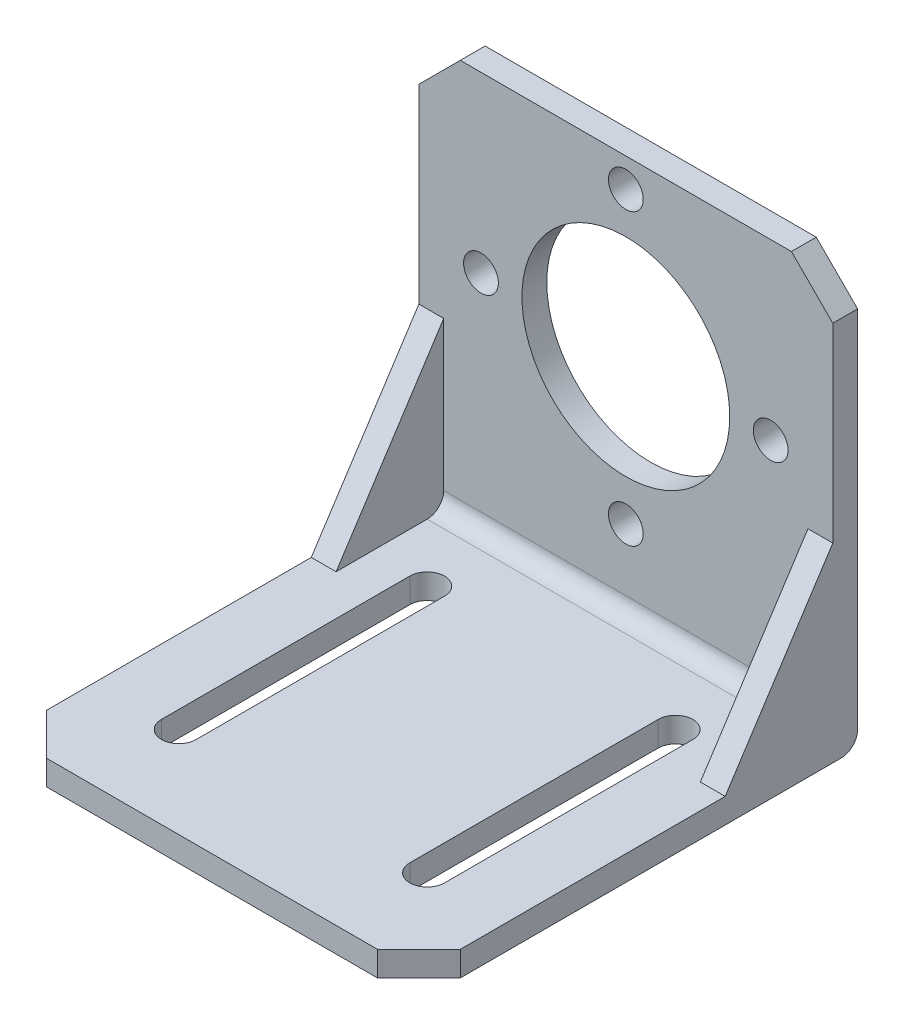
ISO-10303-21;
HEADER;
FILE_DESCRIPTION(('STEP AP214'),'2;1');
FILE_NAME('part.step','',(''),(''),'','','');
FILE_SCHEMA(('AUTOMOTIVE_DESIGN { 1 0 10303 214 1 1 1 1 }'));
ENDSEC;
DATA;
#1=APPLICATION_CONTEXT('core data for automotive mechanical design processes');
#2=APPLICATION_PROTOCOL_DEFINITION('international standard','automotive_design',2000,#1);
#3=PRODUCT_CONTEXT('',#1,'mechanical');
#4=PRODUCT('Part','Part','',(#3));
#5=PRODUCT_RELATED_PRODUCT_CATEGORY('part','',(#4));
#6=PRODUCT_DEFINITION_FORMATION('','',#4);
#7=PRODUCT_DEFINITION_CONTEXT('part definition',#1,'design');
#8=PRODUCT_DEFINITION('design','',#6,#7);
#9=PRODUCT_DEFINITION_SHAPE('','',#8);
#10=(LENGTH_UNIT() NAMED_UNIT(*) SI_UNIT(.MILLI.,.METRE.));
#11=(NAMED_UNIT(*) PLANE_ANGLE_UNIT() SI_UNIT($,.RADIAN.));
#12=(NAMED_UNIT(*) SI_UNIT($,.STERADIAN.) SOLID_ANGLE_UNIT());
#13=UNCERTAINTY_MEASURE_WITH_UNIT(LENGTH_MEASURE(1.E-05),#10,'distance_accuracy_value','');
#14=(GEOMETRIC_REPRESENTATION_CONTEXT(3) GLOBAL_UNCERTAINTY_ASSIGNED_CONTEXT((#13)) GLOBAL_UNIT_ASSIGNED_CONTEXT((#10,
#11,#12)) REPRESENTATION_CONTEXT('',''));
#15=CARTESIAN_POINT('',(0.,0.,0.));
#16=DIRECTION('',(0.,0.,1.));
#17=DIRECTION('',(1.,0.,0.));
#18=AXIS2_PLACEMENT_3D('',#15,#16,#17);
#19=CARTESIAN_POINT('',(0.,0.,3.));
#20=DIRECTION('',(0.,0.,-1.));
#21=DIRECTION('',(-1.,0.,0.));
#22=AXIS2_PLACEMENT_3D('',#19,#20,#21);
#23=PLANE('',#22);
#24=CARTESIAN_POINT('',(0.,4.5,3.));
#25=DIRECTION('',(0.,0.,1.));
#26=DIRECTION('',(1.,0.,0.));
#27=AXIS2_PLACEMENT_3D('',#24,#25,#26);
#28=CIRCLE('',#27,12.55);
#29=CARTESIAN_POINT('',(12.55,4.5,3.));
#30=VERTEX_POINT('',#29);
#31=EDGE_CURVE('E255',#30,#30,#28,.T.);
#32=ORIENTED_EDGE('',*,*,#31,.F.);
#33=EDGE_LOOP('',(#32));
#34=FACE_BOUND('',#33,.T.);
#35=CARTESIAN_POINT('',(-17.5,4.5,3.));
#36=DIRECTION('',(0.,0.,1.));
#37=DIRECTION('',(1.,0.,0.));
#38=AXIS2_PLACEMENT_3D('',#35,#36,#37);
#39=CIRCLE('',#38,2.1);
#40=CARTESIAN_POINT('',(-15.4,4.5,3.));
#41=VERTEX_POINT('',#40);
#42=EDGE_CURVE('E243',#41,#41,#39,.T.);
#43=ORIENTED_EDGE('',*,*,#42,.F.);
#44=EDGE_LOOP('',(#43));
#45=FACE_BOUND('',#44,.T.);
#46=CARTESIAN_POINT('',(17.5,4.5,3.));
#47=DIRECTION('',(0.,0.,1.));
#48=DIRECTION('',(1.,0.,0.));
#49=AXIS2_PLACEMENT_3D('',#46,#47,#48);
#50=CIRCLE('',#49,2.1);
#51=CARTESIAN_POINT('',(19.6,4.5,3.));
#52=VERTEX_POINT('',#51);
#53=EDGE_CURVE('E246',#52,#52,#50,.T.);
#54=ORIENTED_EDGE('',*,*,#53,.F.);
#55=EDGE_LOOP('',(#54));
#56=FACE_BOUND('',#55,.T.);
#57=CARTESIAN_POINT('',(0.,-13.,3.));
#58=DIRECTION('',(0.,0.,1.));
#59=DIRECTION('',(1.,0.,0.));
#60=AXIS2_PLACEMENT_3D('',#57,#58,#59);
#61=CIRCLE('',#60,2.1);
#62=CARTESIAN_POINT('',(2.1,-13.,3.));
#63=VERTEX_POINT('',#62);
#64=EDGE_CURVE('E249',#63,#63,#61,.T.);
#65=ORIENTED_EDGE('',*,*,#64,.F.);
#66=EDGE_LOOP('',(#65));
#67=FACE_BOUND('',#66,.T.);
#68=CARTESIAN_POINT('',(0.,22.,3.));
#69=DIRECTION('',(0.,0.,1.));
#70=DIRECTION('',(1.,0.,0.));
#71=AXIS2_PLACEMENT_3D('',#68,#69,#70);
#72=CIRCLE('',#71,2.1);
#73=CARTESIAN_POINT('',(2.1,22.,3.));
#74=VERTEX_POINT('',#73);
#75=EDGE_CURVE('E252',#74,#74,#72,.T.);
#76=ORIENTED_EDGE('',*,*,#75,.F.);
#77=EDGE_LOOP('',(#76));
#78=FACE_BOUND('',#77,.T.);
#79=DIRECTION('',(1.,0.,0.));
#80=VECTOR('',#79,1.);
#81=CARTESIAN_POINT('',(22.,-2.5,3.));
#82=LINE('',#81,#80);
#83=CARTESIAN_POINT('',(22.,-2.5,3.));
#84=VERTEX_POINT('',#83);
#85=CARTESIAN_POINT('',(25.,-2.5,3.));
#86=VERTEX_POINT('',#85);
#87=EDGE_CURVE('E207',#84,#86,#82,.T.);
#88=ORIENTED_EDGE('',*,*,#87,.T.);
#89=DIRECTION('',(0.,1.,0.));
#90=VECTOR('',#89,1.);
#91=CARTESIAN_POINT('',(25.,-25.5,3.));
#92=LINE('',#91,#90);
#93=CARTESIAN_POINT('',(25.,20.5,3.));
#94=VERTEX_POINT('',#93);
#95=EDGE_CURVE('E334',#86,#94,#92,.T.);
#96=ORIENTED_EDGE('',*,*,#95,.T.);
#97=DIRECTION('',(0.707106781186547,-0.707106781186549,0.));
#98=VECTOR('',#97,1.);
#99=CARTESIAN_POINT('',(20.,25.5,3.));
#100=LINE('',#99,#98);
#101=CARTESIAN_POINT('',(20.,25.5,3.));
#102=VERTEX_POINT('',#101);
#103=EDGE_CURVE('E11',#94,#102,#100,.F.);
#104=ORIENTED_EDGE('',*,*,#103,.T.);
#105=DIRECTION('',(-1.,0.,0.));
#106=VECTOR('',#105,1.);
#107=CARTESIAN_POINT('',(-25.,25.5,3.));
#108=LINE('',#107,#106);
#109=CARTESIAN_POINT('',(-20.,25.5,3.));
#110=VERTEX_POINT('',#109);
#111=EDGE_CURVE('E336',#102,#110,#108,.T.);
#112=ORIENTED_EDGE('',*,*,#111,.T.);
#113=DIRECTION('',(0.707106781186549,0.707106781186547,0.));
#114=VECTOR('',#113,1.);
#115=CARTESIAN_POINT('',(-25.,20.5,3.));
#116=LINE('',#115,#114);
#117=CARTESIAN_POINT('',(-25.,20.5,3.));
#118=VERTEX_POINT('',#117);
#119=EDGE_CURVE('E43',#110,#118,#116,.F.);
#120=ORIENTED_EDGE('',*,*,#119,.T.);
#121=DIRECTION('',(0.,-1.,0.));
#122=VECTOR('',#121,1.);
#123=CARTESIAN_POINT('',(-25.,-25.5,3.));
#124=LINE('',#123,#122);
#125=CARTESIAN_POINT('',(-25.,-2.5,3.));
#126=VERTEX_POINT('',#125);
#127=EDGE_CURVE('E340',#118,#126,#124,.T.);
#128=ORIENTED_EDGE('',*,*,#127,.T.);
#129=DIRECTION('',(-1.,0.,0.));
#130=VECTOR('',#129,1.);
#131=CARTESIAN_POINT('',(-22.,-2.5,3.));
#132=LINE('',#131,#130);
#133=CARTESIAN_POINT('',(-22.,-2.5,3.));
#134=VERTEX_POINT('',#133);
#135=EDGE_CURVE('E241',#134,#126,#132,.T.);
#136=ORIENTED_EDGE('',*,*,#135,.F.);
#137=DIRECTION('',(0.,-1.,0.));
#138=VECTOR('',#137,1.);
#139=CARTESIAN_POINT('',(-22.,-20.5,3.));
#140=LINE('',#139,#138);
#141=CARTESIAN_POINT('',(-22.,-20.5,3.));
#142=VERTEX_POINT('',#141);
#143=EDGE_CURVE('E227',#134,#142,#140,.T.);
#144=ORIENTED_EDGE('',*,*,#143,.T.);
#145=DIRECTION('',(-1.,0.,0.));
#146=VECTOR('',#145,1.);
#147=CARTESIAN_POINT('',(25.,-20.5,3.));
#148=LINE('',#147,#146);
#149=CARTESIAN_POINT('',(22.,-20.5,3.));
#150=VERTEX_POINT('',#149);
#151=EDGE_CURVE('E219',#142,#150,#148,.F.);
#152=ORIENTED_EDGE('',*,*,#151,.T.);
#153=DIRECTION('',(0.,-1.,0.));
#154=VECTOR('',#153,1.);
#155=CARTESIAN_POINT('',(22.,-20.5,3.));
#156=LINE('',#155,#154);
#157=EDGE_CURVE('E199',#84,#150,#156,.T.);
#158=ORIENTED_EDGE('',*,*,#157,.F.);
#159=EDGE_LOOP('',(#88,#96,#104,#112,#120,#128,#136,#144,#152,#158));
#160=FACE_BOUND('',#159,.T.);
#161=ADVANCED_FACE('F34',(#34,#45,#56,#67,#78,#160),#23,.F.);
#162=CARTESIAN_POINT('',(-25.,-22.5,53.));
#163=DIRECTION('',(0.,-1.,0.));
#164=DIRECTION('',(0.,0.,-1.));
#165=AXIS2_PLACEMENT_3D('',#162,#163,#164);
#166=PLANE('',#165);
#167=DIRECTION('',(0.,0.,-1.));
#168=VECTOR('',#167,1.);
#169=CARTESIAN_POINT('',(17.1,-22.5,42.));
#170=LINE('',#169,#168);
#171=CARTESIAN_POINT('',(17.1,-22.5,42.));
#172=VERTEX_POINT('',#171);
#173=CARTESIAN_POINT('',(17.1,-22.5,12.));
#174=VERTEX_POINT('',#173);
#175=EDGE_CURVE('E283',#172,#174,#170,.T.);
#176=ORIENTED_EDGE('',*,*,#175,.F.);
#177=CARTESIAN_POINT('',(15.,-22.5,42.));
#178=DIRECTION('',(0.,1.,0.));
#179=DIRECTION('',(0.,0.,1.));
#180=AXIS2_PLACEMENT_3D('',#177,#178,#179);
#181=CIRCLE('',#180,2.1);
#182=CARTESIAN_POINT('',(12.9,-22.5,42.));
#183=VERTEX_POINT('',#182);
#184=EDGE_CURVE('E281',#183,#172,#181,.T.);
#185=ORIENTED_EDGE('',*,*,#184,.F.);
#186=DIRECTION('',(0.,0.,1.));
#187=VECTOR('',#186,1.);
#188=CARTESIAN_POINT('',(12.9,-22.5,42.));
#189=LINE('',#188,#187);
#190=CARTESIAN_POINT('',(12.9,-22.5,12.));
#191=VERTEX_POINT('',#190);
#192=EDGE_CURVE('E288',#191,#183,#189,.T.);
#193=ORIENTED_EDGE('',*,*,#192,.F.);
#194=CARTESIAN_POINT('',(15.,-22.5,12.));
#195=DIRECTION('',(0.,1.,0.));
#196=DIRECTION('',(0.,0.,1.));
#197=AXIS2_PLACEMENT_3D('',#194,#195,#196);
#198=CIRCLE('',#197,2.1);
#199=EDGE_CURVE('E285',#174,#191,#198,.T.);
#200=ORIENTED_EDGE('',*,*,#199,.F.);
#201=EDGE_LOOP('',(#176,#185,#193,#200));
#202=FACE_BOUND('',#201,.T.);
#203=DIRECTION('',(0.,0.,-1.));
#204=VECTOR('',#203,1.);
#205=CARTESIAN_POINT('',(-12.9,-22.5,42.));
#206=LINE('',#205,#204);
#207=CARTESIAN_POINT('',(-12.9,-22.5,42.));
#208=VERTEX_POINT('',#207);
#209=CARTESIAN_POINT('',(-12.9,-22.5,12.));
#210=VERTEX_POINT('',#209);
#211=EDGE_CURVE('E263',#208,#210,#206,.T.);
#212=ORIENTED_EDGE('',*,*,#211,.F.);
#213=CARTESIAN_POINT('',(-15.,-22.5,42.));
#214=DIRECTION('',(0.,1.,0.));
#215=DIRECTION('',(0.,0.,1.));
#216=AXIS2_PLACEMENT_3D('',#213,#214,#215);
#217=CIRCLE('',#216,2.1);
#218=CARTESIAN_POINT('',(-17.1,-22.5,42.));
#219=VERTEX_POINT('',#218);
#220=EDGE_CURVE('E261',#219,#208,#217,.T.);
#221=ORIENTED_EDGE('',*,*,#220,.F.);
#222=DIRECTION('',(0.,0.,1.));
#223=VECTOR('',#222,1.);
#224=CARTESIAN_POINT('',(-17.1,-22.5,42.));
#225=LINE('',#224,#223);
#226=CARTESIAN_POINT('',(-17.1,-22.5,12.));
#227=VERTEX_POINT('',#226);
#228=EDGE_CURVE('E269',#227,#219,#225,.T.);
#229=ORIENTED_EDGE('',*,*,#228,.F.);
#230=CARTESIAN_POINT('',(-15.,-22.5,12.));
#231=DIRECTION('',(0.,1.,0.));
#232=DIRECTION('',(0.,0.,1.));
#233=AXIS2_PLACEMENT_3D('',#230,#231,#232);
#234=CIRCLE('',#233,2.1);
#235=EDGE_CURVE('E266',#210,#227,#234,.T.);
#236=ORIENTED_EDGE('',*,*,#235,.F.);
#237=EDGE_LOOP('',(#212,#221,#229,#236));
#238=FACE_BOUND('',#237,.T.);
#239=DIRECTION('',(1.,0.,0.));
#240=VECTOR('',#239,1.);
#241=CARTESIAN_POINT('',(22.,-22.5,16.));
#242=LINE('',#241,#240);
#243=CARTESIAN_POINT('',(22.,-22.5,16.));
#244=VERTEX_POINT('',#243);
#245=CARTESIAN_POINT('',(25.,-22.5,16.));
#246=VERTEX_POINT('',#245);
#247=EDGE_CURVE('E213',#244,#246,#242,.T.);
#248=ORIENTED_EDGE('',*,*,#247,.F.);
#249=DIRECTION('',(0.,0.,1.));
#250=VECTOR('',#249,1.);
#251=CARTESIAN_POINT('',(22.,-22.5,16.));
#252=LINE('',#251,#250);
#253=CARTESIAN_POINT('',(22.,-22.5,5.));
#254=VERTEX_POINT('',#253);
#255=EDGE_CURVE('E202',#254,#244,#252,.T.);
#256=ORIENTED_EDGE('',*,*,#255,.F.);
#257=DIRECTION('',(-1.,0.,0.));
#258=VECTOR('',#257,1.);
#259=CARTESIAN_POINT('',(-25.,-22.5,5.));
#260=LINE('',#259,#258);
#261=CARTESIAN_POINT('',(-22.,-22.5,5.));
#262=VERTEX_POINT('',#261);
#263=EDGE_CURVE('E364',#254,#262,#260,.T.);
#264=ORIENTED_EDGE('',*,*,#263,.T.);
#265=DIRECTION('',(0.,0.,1.));
#266=VECTOR('',#265,1.);
#267=CARTESIAN_POINT('',(-22.,-22.5,16.));
#268=LINE('',#267,#266);
#269=CARTESIAN_POINT('',(-22.,-22.5,16.));
#270=VERTEX_POINT('',#269);
#271=EDGE_CURVE('E232',#262,#270,#268,.T.);
#272=ORIENTED_EDGE('',*,*,#271,.T.);
#273=DIRECTION('',(-1.,0.,0.));
#274=VECTOR('',#273,1.);
#275=CARTESIAN_POINT('',(-22.,-22.5,16.));
#276=LINE('',#275,#274);
#277=CARTESIAN_POINT('',(-25.,-22.5,16.));
#278=VERTEX_POINT('',#277);
#279=EDGE_CURVE('E238',#270,#278,#276,.T.);
#280=ORIENTED_EDGE('',*,*,#279,.T.);
#281=DIRECTION('',(0.,0.,-1.));
#282=VECTOR('',#281,1.);
#283=CARTESIAN_POINT('',(-25.,-22.5,53.));
#284=LINE('',#283,#282);
#285=CARTESIAN_POINT('',(-25.,-22.5,48.));
#286=VERTEX_POINT('',#285);
#287=EDGE_CURVE('E327',#286,#278,#284,.T.);
#288=ORIENTED_EDGE('',*,*,#287,.F.);
#289=DIRECTION('',(-0.707106781186547,0.,-0.707106781186549));
#290=VECTOR('',#289,1.);
#291=CARTESIAN_POINT('',(-20.,-22.5,53.));
#292=LINE('',#291,#290);
#293=CARTESIAN_POINT('',(-20.,-22.5,53.));
#294=VERTEX_POINT('',#293);
#295=EDGE_CURVE('E384',#286,#294,#292,.F.);
#296=ORIENTED_EDGE('',*,*,#295,.T.);
#297=DIRECTION('',(-1.,0.,0.));
#298=VECTOR('',#297,1.);
#299=CARTESIAN_POINT('',(-25.,-22.5,53.));
#300=LINE('',#299,#298);
#301=CARTESIAN_POINT('',(20.,-22.5,53.));
#302=VERTEX_POINT('',#301);
#303=EDGE_CURVE('E324',#302,#294,#300,.T.);
#304=ORIENTED_EDGE('',*,*,#303,.F.);
#305=DIRECTION('',(-0.707106781186547,0.,0.707106781186549));
#306=VECTOR('',#305,1.);
#307=CARTESIAN_POINT('',(20.,-22.5,53.));
#308=LINE('',#307,#306);
#309=CARTESIAN_POINT('',(25.,-22.5,48.));
#310=VERTEX_POINT('',#309);
#311=EDGE_CURVE('E382',#302,#310,#308,.F.);
#312=ORIENTED_EDGE('',*,*,#311,.T.);
#313=DIRECTION('',(0.,0.,-1.));
#314=VECTOR('',#313,1.);
#315=CARTESIAN_POINT('',(25.,-22.5,53.));
#316=LINE('',#315,#314);
#317=EDGE_CURVE('E330',#310,#246,#316,.T.);
#318=ORIENTED_EDGE('',*,*,#317,.T.);
#319=EDGE_LOOP('',(#248,#256,#264,#272,#280,#288,#296,#304,#312,#318));
#320=FACE_BOUND('',#319,.T.);
#321=ADVANCED_FACE('F451',(#202,#238,#320),#166,.F.);
#322=CARTESIAN_POINT('',(25.,-25.5,3.));
#323=DIRECTION('',(-1.,0.,0.));
#324=DIRECTION('',(0.,0.,1.));
#325=AXIS2_PLACEMENT_3D('',#322,#323,#324);
#326=PLANE('',#325);
#327=ORIENTED_EDGE('',*,*,#95,.F.);
#328=DIRECTION('',(0.,0.838443616300637,-0.544988350595414));
#329=VECTOR('',#328,1.);
#330=CARTESIAN_POINT('',(25.,-2.5,3.));
#331=LINE('',#330,#329);
#332=EDGE_CURVE('E210',#246,#86,#331,.T.);
#333=ORIENTED_EDGE('',*,*,#332,.F.);
#334=ORIENTED_EDGE('',*,*,#317,.F.);
#335=DIRECTION('',(0.,-1.,0.));
#336=VECTOR('',#335,1.);
#337=CARTESIAN_POINT('',(25.,-25.5,48.));
#338=LINE('',#337,#336);
#339=CARTESIAN_POINT('',(25.,-25.5,48.));
#340=VERTEX_POINT('',#339);
#341=EDGE_CURVE('E389',#310,#340,#338,.T.);
#342=ORIENTED_EDGE('',*,*,#341,.T.);
#343=DIRECTION('',(0.,0.,-1.));
#344=VECTOR('',#343,1.);
#345=CARTESIAN_POINT('',(25.,-25.5,3.));
#346=LINE('',#345,#344);
#347=CARTESIAN_POINT('',(25.,-25.5,2.));
#348=VERTEX_POINT('',#347);
#349=EDGE_CURVE('E343',#340,#348,#346,.T.);
#350=ORIENTED_EDGE('',*,*,#349,.T.);
#351=CARTESIAN_POINT('',(25.,-23.5,2.));
#352=DIRECTION('',(-1.,0.,0.));
#353=DIRECTION('',(0.,0.,1.));
#354=AXIS2_PLACEMENT_3D('',#351,#352,#353);
#355=CIRCLE('',#354,2.);
#356=CARTESIAN_POINT('',(25.,-23.5,0.));
#357=VERTEX_POINT('',#356);
#358=EDGE_CURVE('E356',#348,#357,#355,.F.);
#359=ORIENTED_EDGE('',*,*,#358,.T.);
#360=DIRECTION('',(0.,1.,0.));
#361=VECTOR('',#360,1.);
#362=CARTESIAN_POINT('',(25.,-25.5,0.));
#363=LINE('',#362,#361);
#364=CARTESIAN_POINT('',(25.,20.5,0.));
#365=VERTEX_POINT('',#364);
#366=EDGE_CURVE('E333',#357,#365,#363,.T.);
#367=ORIENTED_EDGE('',*,*,#366,.T.);
#368=DIRECTION('',(0.,0.,1.));
#369=VECTOR('',#368,1.);
#370=CARTESIAN_POINT('',(25.,20.5,3.));
#371=LINE('',#370,#369);
#372=EDGE_CURVE('E386',#365,#94,#371,.T.);
#373=ORIENTED_EDGE('',*,*,#372,.T.);
#374=EDGE_LOOP('',(#327,#333,#334,#342,#350,#359,#367,#373));
#375=FACE_BOUND('',#374,.T.);
#376=ADVANCED_FACE('F461',(#375),#326,.F.);
#377=CARTESIAN_POINT('',(-25.,25.5,3.));
#378=DIRECTION('',(0.,-1.,0.));
#379=DIRECTION('',(0.,0.,-1.));
#380=AXIS2_PLACEMENT_3D('',#377,#378,#379);
#381=PLANE('',#380);
#382=ORIENTED_EDGE('',*,*,#111,.F.);
#383=DIRECTION('',(0.,0.,-1.));
#384=VECTOR('',#383,1.);
#385=CARTESIAN_POINT('',(20.,25.5,3.));
#386=LINE('',#385,#384);
#387=CARTESIAN_POINT('',(20.,25.5,0.));
#388=VERTEX_POINT('',#387);
#389=EDGE_CURVE('E393',#102,#388,#386,.T.);
#390=ORIENTED_EDGE('',*,*,#389,.T.);
#391=DIRECTION('',(-1.,0.,0.));
#392=VECTOR('',#391,1.);
#393=CARTESIAN_POINT('',(-25.,25.5,0.));
#394=LINE('',#393,#392);
#395=CARTESIAN_POINT('',(-20.,25.5,0.));
#396=VERTEX_POINT('',#395);
#397=EDGE_CURVE('E346',#388,#396,#394,.T.);
#398=ORIENTED_EDGE('',*,*,#397,.T.);
#399=DIRECTION('',(0.,0.,1.));
#400=VECTOR('',#399,1.);
#401=CARTESIAN_POINT('',(-20.,25.5,3.));
#402=LINE('',#401,#400);
#403=EDGE_CURVE('E391',#396,#110,#402,.T.);
#404=ORIENTED_EDGE('',*,*,#403,.T.);
#405=EDGE_LOOP('',(#382,#390,#398,#404));
#406=FACE_BOUND('',#405,.T.);
#407=ADVANCED_FACE('F437',(#406),#381,.F.);
#408=CARTESIAN_POINT('',(-25.,-25.5,3.));
#409=DIRECTION('',(1.,0.,0.));
#410=DIRECTION('',(0.,0.,-1.));
#411=AXIS2_PLACEMENT_3D('',#408,#409,#410);
#412=PLANE('',#411);
#413=ORIENTED_EDGE('',*,*,#287,.T.);
#414=DIRECTION('',(0.,0.838443616300637,-0.544988350595414));
#415=VECTOR('',#414,1.);
#416=CARTESIAN_POINT('',(-25.,-2.5,3.));
#417=LINE('',#416,#415);
#418=EDGE_CURVE('E225',#278,#126,#417,.T.);
#419=ORIENTED_EDGE('',*,*,#418,.T.);
#420=ORIENTED_EDGE('',*,*,#127,.F.);
#421=DIRECTION('',(0.,0.,-1.));
#422=VECTOR('',#421,1.);
#423=CARTESIAN_POINT('',(-25.,20.5,3.));
#424=LINE('',#423,#422);
#425=CARTESIAN_POINT('',(-25.,20.5,0.));
#426=VERTEX_POINT('',#425);
#427=EDGE_CURVE('E377',#118,#426,#424,.T.);
#428=ORIENTED_EDGE('',*,*,#427,.T.);
#429=DIRECTION('',(0.,-1.,0.));
#430=VECTOR('',#429,1.);
#431=CARTESIAN_POINT('',(-25.,-25.5,0.));
#432=LINE('',#431,#430);
#433=CARTESIAN_POINT('',(-25.,-23.5,0.));
#434=VERTEX_POINT('',#433);
#435=EDGE_CURVE('E337',#426,#434,#432,.T.);
#436=ORIENTED_EDGE('',*,*,#435,.T.);
#437=CARTESIAN_POINT('',(-25.,-23.5,2.));
#438=DIRECTION('',(1.,0.,0.));
#439=DIRECTION('',(0.,0.,-1.));
#440=AXIS2_PLACEMENT_3D('',#437,#438,#439);
#441=CIRCLE('',#440,2.);
#442=CARTESIAN_POINT('',(-25.,-25.5,2.));
#443=VERTEX_POINT('',#442);
#444=EDGE_CURVE('E361',#434,#443,#441,.F.);
#445=ORIENTED_EDGE('',*,*,#444,.T.);
#446=DIRECTION('',(0.,0.,-1.));
#447=VECTOR('',#446,1.);
#448=CARTESIAN_POINT('',(-25.,-25.5,3.));
#449=LINE('',#448,#447);
#450=CARTESIAN_POINT('',(-25.,-25.5,48.));
#451=VERTEX_POINT('',#450);
#452=EDGE_CURVE('E351',#451,#443,#449,.T.);
#453=ORIENTED_EDGE('',*,*,#452,.F.);
#454=DIRECTION('',(0.,1.,0.));
#455=VECTOR('',#454,1.);
#456=CARTESIAN_POINT('',(-25.,-25.5,48.));
#457=LINE('',#456,#455);
#458=EDGE_CURVE('E380',#451,#286,#457,.T.);
#459=ORIENTED_EDGE('',*,*,#458,.T.);
#460=EDGE_LOOP('',(#413,#419,#420,#428,#436,#445,#453,#459));
#461=FACE_BOUND('',#460,.T.);
#462=ADVANCED_FACE('F445',(#461),#412,.F.);
#463=CARTESIAN_POINT('',(-25.,-25.5,3.));
#464=DIRECTION('',(0.,1.,0.));
#465=DIRECTION('',(0.,0.,1.));
#466=AXIS2_PLACEMENT_3D('',#463,#464,#465);
#467=PLANE('',#466);
#468=DIRECTION('',(0.,0.,1.));
#469=VECTOR('',#468,1.);
#470=CARTESIAN_POINT('',(-17.1,-25.5,3.));
#471=LINE('',#470,#469);
#472=CARTESIAN_POINT('',(-17.1,-25.5,12.));
#473=VERTEX_POINT('',#472);
#474=CARTESIAN_POINT('',(-17.1,-25.5,42.));
#475=VERTEX_POINT('',#474);
#476=EDGE_CURVE('E315',#473,#475,#471,.T.);
#477=ORIENTED_EDGE('',*,*,#476,.T.);
#478=CARTESIAN_POINT('',(-15.,-25.5,42.));
#479=DIRECTION('',(0.,1.,0.));
#480=DIRECTION('',(0.,0.,1.));
#481=AXIS2_PLACEMENT_3D('',#478,#479,#480);
#482=CIRCLE('',#481,2.1);
#483=CARTESIAN_POINT('',(-12.9,-25.5,42.));
#484=VERTEX_POINT('',#483);
#485=EDGE_CURVE('E318',#475,#484,#482,.T.);
#486=ORIENTED_EDGE('',*,*,#485,.T.);
#487=DIRECTION('',(0.,0.,-1.));
#488=VECTOR('',#487,1.);
#489=CARTESIAN_POINT('',(-12.9,-25.5,3.));
#490=LINE('',#489,#488);
#491=CARTESIAN_POINT('',(-12.9,-25.5,12.));
#492=VERTEX_POINT('',#491);
#493=EDGE_CURVE('E309',#484,#492,#490,.T.);
#494=ORIENTED_EDGE('',*,*,#493,.T.);
#495=CARTESIAN_POINT('',(-15.,-25.5,12.));
#496=DIRECTION('',(0.,1.,0.));
#497=DIRECTION('',(0.,0.,1.));
#498=AXIS2_PLACEMENT_3D('',#495,#496,#497);
#499=CIRCLE('',#498,2.1);
#500=EDGE_CURVE('E312',#492,#473,#499,.T.);
#501=ORIENTED_EDGE('',*,*,#500,.T.);
#502=EDGE_LOOP('',(#477,#486,#494,#501));
#503=FACE_BOUND('',#502,.T.);
#504=DIRECTION('',(0.,0.,1.));
#505=VECTOR('',#504,1.);
#506=CARTESIAN_POINT('',(12.9,-25.5,3.));
#507=LINE('',#506,#505);
#508=CARTESIAN_POINT('',(12.9,-25.5,12.));
#509=VERTEX_POINT('',#508);
#510=CARTESIAN_POINT('',(12.9,-25.5,42.));
#511=VERTEX_POINT('',#510);
#512=EDGE_CURVE('E303',#509,#511,#507,.T.);
#513=ORIENTED_EDGE('',*,*,#512,.T.);
#514=CARTESIAN_POINT('',(15.,-25.5,42.));
#515=DIRECTION('',(0.,1.,0.));
#516=DIRECTION('',(0.,0.,1.));
#517=AXIS2_PLACEMENT_3D('',#514,#515,#516);
#518=CIRCLE('',#517,2.1);
#519=CARTESIAN_POINT('',(17.1,-25.5,42.));
#520=VERTEX_POINT('',#519);
#521=EDGE_CURVE('E306',#511,#520,#518,.T.);
#522=ORIENTED_EDGE('',*,*,#521,.T.);
#523=DIRECTION('',(0.,0.,-1.));
#524=VECTOR('',#523,1.);
#525=CARTESIAN_POINT('',(17.1,-25.5,3.));
#526=LINE('',#525,#524);
#527=CARTESIAN_POINT('',(17.1,-25.5,12.));
#528=VERTEX_POINT('',#527);
#529=EDGE_CURVE('E275',#520,#528,#526,.T.);
#530=ORIENTED_EDGE('',*,*,#529,.T.);
#531=CARTESIAN_POINT('',(15.,-25.5,12.));
#532=DIRECTION('',(0.,1.,0.));
#533=DIRECTION('',(0.,0.,1.));
#534=AXIS2_PLACEMENT_3D('',#531,#532,#533);
#535=CIRCLE('',#534,2.1);
#536=EDGE_CURVE('E300',#528,#509,#535,.T.);
#537=ORIENTED_EDGE('',*,*,#536,.T.);
#538=EDGE_LOOP('',(#513,#522,#530,#537));
#539=FACE_BOUND('',#538,.T.);
#540=DIRECTION('',(1.,0.,0.));
#541=VECTOR('',#540,1.);
#542=CARTESIAN_POINT('',(-25.,-25.5,53.));
#543=LINE('',#542,#541);
#544=CARTESIAN_POINT('',(-20.,-25.5,53.));
#545=VERTEX_POINT('',#544);
#546=CARTESIAN_POINT('',(20.,-25.5,53.));
#547=VERTEX_POINT('',#546);
#548=EDGE_CURVE('E321',#545,#547,#543,.T.);
#549=ORIENTED_EDGE('',*,*,#548,.F.);
#550=DIRECTION('',(0.707106781186547,0.,0.707106781186549));
#551=VECTOR('',#550,1.);
#552=CARTESIAN_POINT('',(-20.,-25.5,53.));
#553=LINE('',#552,#551);
#554=EDGE_CURVE('E375',#545,#451,#553,.F.);
#555=ORIENTED_EDGE('',*,*,#554,.T.);
#556=ORIENTED_EDGE('',*,*,#452,.T.);
#557=DIRECTION('',(1.,0.,0.));
#558=VECTOR('',#557,1.);
#559=CARTESIAN_POINT('',(25.,-25.5,2.));
#560=LINE('',#559,#558);
#561=EDGE_CURVE('E353',#443,#348,#560,.T.);
#562=ORIENTED_EDGE('',*,*,#561,.T.);
#563=ORIENTED_EDGE('',*,*,#349,.F.);
#564=DIRECTION('',(0.707106781186547,0.,-0.707106781186549));
#565=VECTOR('',#564,1.);
#566=CARTESIAN_POINT('',(20.,-25.5,53.));
#567=LINE('',#566,#565);
#568=EDGE_CURVE('E373',#340,#547,#567,.F.);
#569=ORIENTED_EDGE('',*,*,#568,.T.);
#570=EDGE_LOOP('',(#549,#555,#556,#562,#563,#569));
#571=FACE_BOUND('',#570,.T.);
#572=ADVANCED_FACE('F422',(#503,#539,#571),#467,.F.);
#573=CARTESIAN_POINT('',(0.,0.,0.));
#574=DIRECTION('',(0.,0.,-1.));
#575=DIRECTION('',(-1.,0.,0.));
#576=AXIS2_PLACEMENT_3D('',#573,#574,#575);
#577=PLANE('',#576);
#578=CARTESIAN_POINT('',(0.,22.,0.));
#579=DIRECTION('',(0.,0.,-1.));
#580=DIRECTION('',(-1.,0.,0.));
#581=AXIS2_PLACEMENT_3D('',#578,#579,#580);
#582=CIRCLE('',#581,2.1);
#583=CARTESIAN_POINT('',(-2.1,22.,0.));
#584=VERTEX_POINT('',#583);
#585=EDGE_CURVE('E38',#584,#584,#582,.T.);
#586=ORIENTED_EDGE('',*,*,#585,.F.);
#587=EDGE_LOOP('',(#586));
#588=FACE_BOUND('',#587,.T.);
#589=CARTESIAN_POINT('',(0.,-13.,0.));
#590=DIRECTION('',(0.,0.,-1.));
#591=DIRECTION('',(-1.,0.,0.));
#592=AXIS2_PLACEMENT_3D('',#589,#590,#591);
#593=CIRCLE('',#592,2.1);
#594=CARTESIAN_POINT('',(-2.1,-13.,0.));
#595=VERTEX_POINT('',#594);
#596=EDGE_CURVE('E408',#595,#595,#593,.T.);
#597=ORIENTED_EDGE('',*,*,#596,.F.);
#598=EDGE_LOOP('',(#597));
#599=FACE_BOUND('',#598,.T.);
#600=CARTESIAN_POINT('',(17.5,4.5,0.));
#601=DIRECTION('',(0.,0.,-1.));
#602=DIRECTION('',(-1.,0.,0.));
#603=AXIS2_PLACEMENT_3D('',#600,#601,#602);
#604=CIRCLE('',#603,2.1);
#605=CARTESIAN_POINT('',(15.4,4.5,0.));
#606=VERTEX_POINT('',#605);
#607=EDGE_CURVE('E406',#606,#606,#604,.T.);
#608=ORIENTED_EDGE('',*,*,#607,.F.);
#609=EDGE_LOOP('',(#608));
#610=FACE_BOUND('',#609,.T.);
#611=CARTESIAN_POINT('',(-17.5,4.5,0.));
#612=DIRECTION('',(0.,0.,-1.));
#613=DIRECTION('',(-1.,0.,0.));
#614=AXIS2_PLACEMENT_3D('',#611,#612,#613);
#615=CIRCLE('',#614,2.1);
#616=CARTESIAN_POINT('',(-19.6,4.5,0.));
#617=VERTEX_POINT('',#616);
#618=EDGE_CURVE('E403',#617,#617,#615,.T.);
#619=ORIENTED_EDGE('',*,*,#618,.F.);
#620=EDGE_LOOP('',(#619));
#621=FACE_BOUND('',#620,.T.);
#622=CARTESIAN_POINT('',(0.,4.5,0.));
#623=DIRECTION('',(0.,0.,-1.));
#624=DIRECTION('',(-1.,0.,0.));
#625=AXIS2_PLACEMENT_3D('',#622,#623,#624);
#626=CIRCLE('',#625,12.55);
#627=CARTESIAN_POINT('',(-12.55,4.5,0.));
#628=VERTEX_POINT('',#627);
#629=EDGE_CURVE('E260',#628,#628,#626,.T.);
#630=ORIENTED_EDGE('',*,*,#629,.F.);
#631=EDGE_LOOP('',(#630));
#632=FACE_BOUND('',#631,.T.);
#633=ORIENTED_EDGE('',*,*,#397,.F.);
#634=DIRECTION('',(-0.707106781186547,0.707106781186549,0.));
#635=VECTOR('',#634,1.);
#636=CARTESIAN_POINT('',(22.75,22.75,0.));
#637=LINE('',#636,#635);
#638=EDGE_CURVE('E398',#388,#365,#637,.F.);
#639=ORIENTED_EDGE('',*,*,#638,.T.);
#640=ORIENTED_EDGE('',*,*,#366,.F.);
#641=DIRECTION('',(1.,0.,0.));
#642=VECTOR('',#641,1.);
#643=CARTESIAN_POINT('',(-25.,-23.5,0.));
#644=LINE('',#643,#642);
#645=EDGE_CURVE('E358',#357,#434,#644,.F.);
#646=ORIENTED_EDGE('',*,*,#645,.T.);
#647=ORIENTED_EDGE('',*,*,#435,.F.);
#648=DIRECTION('',(-0.707106781186549,-0.707106781186547,0.));
#649=VECTOR('',#648,1.);
#650=CARTESIAN_POINT('',(-22.75,22.75,0.));
#651=LINE('',#650,#649);
#652=EDGE_CURVE('E396',#426,#396,#651,.F.);
#653=ORIENTED_EDGE('',*,*,#652,.T.);
#654=EDGE_LOOP('',(#633,#639,#640,#646,#647,#653));
#655=FACE_BOUND('',#654,.T.);
#656=ADVANCED_FACE('F418',(#588,#599,#610,#621,#632,#655),#577,.T.);
#657=CARTESIAN_POINT('',(0.,0.,53.));
#658=DIRECTION('',(0.,0.,-1.));
#659=DIRECTION('',(-1.,0.,0.));
#660=AXIS2_PLACEMENT_3D('',#657,#658,#659);
#661=PLANE('',#660);
#662=ORIENTED_EDGE('',*,*,#303,.T.);
#663=DIRECTION('',(0.,-1.,0.));
#664=VECTOR('',#663,1.);
#665=CARTESIAN_POINT('',(-20.,0.,53.));
#666=LINE('',#665,#664);
#667=EDGE_CURVE('E370',#294,#545,#666,.T.);
#668=ORIENTED_EDGE('',*,*,#667,.T.);
#669=ORIENTED_EDGE('',*,*,#548,.T.);
#670=DIRECTION('',(0.,1.,0.));
#671=VECTOR('',#670,1.);
#672=CARTESIAN_POINT('',(20.,0.,53.));
#673=LINE('',#672,#671);
#674=EDGE_CURVE('E367',#547,#302,#673,.T.);
#675=ORIENTED_EDGE('',*,*,#674,.T.);
#676=EDGE_LOOP('',(#662,#668,#669,#675));
#677=FACE_BOUND('',#676,.T.);
#678=ADVANCED_FACE('F421',(#677),#661,.F.);
#679=CARTESIAN_POINT('',(-25.,-23.5,2.));
#680=DIRECTION('',(-1.,0.,0.));
#681=DIRECTION('',(0.,0.,1.));
#682=AXIS2_PLACEMENT_3D('',#679,#680,#681);
#683=CYLINDRICAL_SURFACE('',#682,2.);
#684=ORIENTED_EDGE('',*,*,#444,.F.);
#685=ORIENTED_EDGE('',*,*,#645,.F.);
#686=ORIENTED_EDGE('',*,*,#358,.F.);
#687=ORIENTED_EDGE('',*,*,#561,.F.);
#688=EDGE_LOOP('',(#684,#685,#686,#687));
#689=FACE_BOUND('',#688,.T.);
#690=ADVANCED_FACE('F498',(#689),#683,.T.);
#691=CARTESIAN_POINT('',(-25.,-20.5,5.));
#692=DIRECTION('',(1.,0.,0.));
#693=DIRECTION('',(0.,0.,-1.));
#694=AXIS2_PLACEMENT_3D('',#691,#692,#693);
#695=CYLINDRICAL_SURFACE('',#694,2.);
#696=ORIENTED_EDGE('',*,*,#263,.F.);
#697=CARTESIAN_POINT('',(22.,-20.5,5.));
#698=DIRECTION('',(-1.,0.,0.));
#699=DIRECTION('',(0.,0.,-1.));
#700=AXIS2_PLACEMENT_3D('',#697,#698,#699);
#701=CIRCLE('',#700,2.);
#702=EDGE_CURVE('E214',#150,#254,#701,.T.);
#703=ORIENTED_EDGE('',*,*,#702,.F.);
#704=ORIENTED_EDGE('',*,*,#151,.F.);
#705=CARTESIAN_POINT('',(-22.,-20.5,5.));
#706=DIRECTION('',(-1.,0.,0.));
#707=DIRECTION('',(0.,0.,-1.));
#708=AXIS2_PLACEMENT_3D('',#705,#706,#707);
#709=CIRCLE('',#708,2.);
#710=EDGE_CURVE('E229',#142,#262,#709,.T.);
#711=ORIENTED_EDGE('',*,*,#710,.T.);
#712=EDGE_LOOP('',(#696,#703,#704,#711));
#713=FACE_BOUND('',#712,.T.);
#714=ADVANCED_FACE('F458',(#713),#695,.F.);
#715=CARTESIAN_POINT('',(-20.,0.,53.));
#716=DIRECTION('',(0.707106781186549,0.,-0.707106781186547));
#717=DIRECTION('',(0.,-1.,0.));
#718=AXIS2_PLACEMENT_3D('',#715,#716,#717);
#719=PLANE('',#718);
#720=ORIENTED_EDGE('',*,*,#295,.F.);
#721=ORIENTED_EDGE('',*,*,#458,.F.);
#722=ORIENTED_EDGE('',*,*,#554,.F.);
#723=ORIENTED_EDGE('',*,*,#667,.F.);
#724=EDGE_LOOP('',(#720,#721,#722,#723));
#725=FACE_BOUND('',#724,.T.);
#726=ADVANCED_FACE('F474',(#725),#719,.F.);
#727=CARTESIAN_POINT('',(20.,0.,53.));
#728=DIRECTION('',(-0.707106781186548,0.,-0.707106781186546));
#729=DIRECTION('',(0.,1.,0.));
#730=AXIS2_PLACEMENT_3D('',#727,#728,#729);
#731=PLANE('',#730);
#732=ORIENTED_EDGE('',*,*,#568,.F.);
#733=ORIENTED_EDGE('',*,*,#341,.F.);
#734=ORIENTED_EDGE('',*,*,#311,.F.);
#735=ORIENTED_EDGE('',*,*,#674,.F.);
#736=EDGE_LOOP('',(#732,#733,#734,#735));
#737=FACE_BOUND('',#736,.T.);
#738=ADVANCED_FACE('F468',(#737),#731,.F.);
#739=CARTESIAN_POINT('',(20.,25.5,3.));
#740=DIRECTION('',(-0.707106781186548,-0.707106781186546,0.));
#741=DIRECTION('',(0.,0.,-1.));
#742=AXIS2_PLACEMENT_3D('',#739,#740,#741);
#743=PLANE('',#742);
#744=ORIENTED_EDGE('',*,*,#103,.F.);
#745=ORIENTED_EDGE('',*,*,#372,.F.);
#746=ORIENTED_EDGE('',*,*,#638,.F.);
#747=ORIENTED_EDGE('',*,*,#389,.F.);
#748=EDGE_LOOP('',(#744,#745,#746,#747));
#749=FACE_BOUND('',#748,.T.);
#750=ADVANCED_FACE('F466',(#749),#743,.F.);
#751=CARTESIAN_POINT('',(-25.,20.5,3.));
#752=DIRECTION('',(0.707106781186547,-0.707106781186549,0.));
#753=DIRECTION('',(0.,0.,-1.));
#754=AXIS2_PLACEMENT_3D('',#751,#752,#753);
#755=PLANE('',#754);
#756=ORIENTED_EDGE('',*,*,#119,.F.);
#757=ORIENTED_EDGE('',*,*,#403,.F.);
#758=ORIENTED_EDGE('',*,*,#652,.F.);
#759=ORIENTED_EDGE('',*,*,#427,.F.);
#760=EDGE_LOOP('',(#756,#757,#758,#759));
#761=FACE_BOUND('',#760,.T.);
#762=ADVANCED_FACE('F36',(#761),#755,.F.);
#763=CARTESIAN_POINT('',(15.,-72.5,42.));
#764=DIRECTION('',(0.,1.,0.));
#765=DIRECTION('',(0.,0.,1.));
#766=AXIS2_PLACEMENT_3D('',#763,#764,#765);
#767=CYLINDRICAL_SURFACE('',#766,2.1);
#768=DIRECTION('',(0.,1.,0.));
#769=VECTOR('',#768,1.);
#770=CARTESIAN_POINT('',(12.9,-72.5,42.));
#771=LINE('',#770,#769);
#772=EDGE_CURVE('E264',#511,#183,#771,.T.);
#773=ORIENTED_EDGE('',*,*,#772,.T.);
#774=ORIENTED_EDGE('',*,*,#184,.T.);
#775=DIRECTION('',(0.,1.,0.));
#776=VECTOR('',#775,1.);
#777=CARTESIAN_POINT('',(17.1,-72.5,42.));
#778=LINE('',#777,#776);
#779=EDGE_CURVE('E291',#520,#172,#778,.T.);
#780=ORIENTED_EDGE('',*,*,#779,.F.);
#781=ORIENTED_EDGE('',*,*,#521,.F.);
#782=EDGE_LOOP('',(#773,#774,#780,#781));
#783=FACE_BOUND('',#782,.T.);
#784=ADVANCED_FACE('F473',(#783),#767,.F.);
#785=CARTESIAN_POINT('',(12.9,-72.5,42.));
#786=DIRECTION('',(-1.,0.,0.));
#787=DIRECTION('',(0.,0.,1.));
#788=AXIS2_PLACEMENT_3D('',#785,#786,#787);
#789=PLANE('',#788);
#790=DIRECTION('',(0.,1.,0.));
#791=VECTOR('',#790,1.);
#792=CARTESIAN_POINT('',(12.9,-72.5,12.));
#793=LINE('',#792,#791);
#794=EDGE_CURVE('E293',#509,#191,#793,.T.);
#795=ORIENTED_EDGE('',*,*,#794,.T.);
#796=ORIENTED_EDGE('',*,*,#192,.T.);
#797=ORIENTED_EDGE('',*,*,#772,.F.);
#798=ORIENTED_EDGE('',*,*,#512,.F.);
#799=EDGE_LOOP('',(#795,#796,#797,#798));
#800=FACE_BOUND('',#799,.T.);
#801=ADVANCED_FACE('F528',(#800),#789,.F.);
#802=CARTESIAN_POINT('',(15.,-72.5,12.));
#803=DIRECTION('',(0.,1.,0.));
#804=DIRECTION('',(0.,0.,1.));
#805=AXIS2_PLACEMENT_3D('',#802,#803,#804);
#806=CYLINDRICAL_SURFACE('',#805,2.1);
#807=DIRECTION('',(0.,1.,0.));
#808=VECTOR('',#807,1.);
#809=CARTESIAN_POINT('',(17.1,-72.5,12.));
#810=LINE('',#809,#808);
#811=EDGE_CURVE('E59',#528,#174,#810,.T.);
#812=ORIENTED_EDGE('',*,*,#811,.T.);
#813=ORIENTED_EDGE('',*,*,#199,.T.);
#814=ORIENTED_EDGE('',*,*,#794,.F.);
#815=ORIENTED_EDGE('',*,*,#536,.F.);
#816=EDGE_LOOP('',(#812,#813,#814,#815));
#817=FACE_BOUND('',#816,.T.);
#818=ADVANCED_FACE('F534',(#817),#806,.F.);
#819=CARTESIAN_POINT('',(17.1,-72.5,42.));
#820=DIRECTION('',(1.,0.,0.));
#821=DIRECTION('',(0.,0.,-1.));
#822=AXIS2_PLACEMENT_3D('',#819,#820,#821);
#823=PLANE('',#822);
#824=ORIENTED_EDGE('',*,*,#779,.T.);
#825=ORIENTED_EDGE('',*,*,#175,.T.);
#826=ORIENTED_EDGE('',*,*,#811,.F.);
#827=ORIENTED_EDGE('',*,*,#529,.F.);
#828=EDGE_LOOP('',(#824,#825,#826,#827));
#829=FACE_BOUND('',#828,.T.);
#830=ADVANCED_FACE('F530',(#829),#823,.F.);
#831=CARTESIAN_POINT('',(-15.,-72.5,42.));
#832=DIRECTION('',(0.,1.,0.));
#833=DIRECTION('',(0.,0.,1.));
#834=AXIS2_PLACEMENT_3D('',#831,#832,#833);
#835=CYLINDRICAL_SURFACE('',#834,2.1);
#836=DIRECTION('',(0.,1.,0.));
#837=VECTOR('',#836,1.);
#838=CARTESIAN_POINT('',(-17.1,-72.5,42.));
#839=LINE('',#838,#837);
#840=EDGE_CURVE('E273',#475,#219,#839,.T.);
#841=ORIENTED_EDGE('',*,*,#840,.T.);
#842=ORIENTED_EDGE('',*,*,#220,.T.);
#843=DIRECTION('',(0.,1.,0.));
#844=VECTOR('',#843,1.);
#845=CARTESIAN_POINT('',(-12.9,-72.5,42.));
#846=LINE('',#845,#844);
#847=EDGE_CURVE('E272',#484,#208,#846,.T.);
#848=ORIENTED_EDGE('',*,*,#847,.F.);
#849=ORIENTED_EDGE('',*,*,#485,.F.);
#850=EDGE_LOOP('',(#841,#842,#848,#849));
#851=FACE_BOUND('',#850,.T.);
#852=ADVANCED_FACE('F533',(#851),#835,.F.);
#853=CARTESIAN_POINT('',(-17.1,-72.5,42.));
#854=DIRECTION('',(-1.,0.,0.));
#855=DIRECTION('',(0.,0.,1.));
#856=AXIS2_PLACEMENT_3D('',#853,#854,#855);
#857=PLANE('',#856);
#858=DIRECTION('',(0.,1.,0.));
#859=VECTOR('',#858,1.);
#860=CARTESIAN_POINT('',(-17.1,-72.5,12.));
#861=LINE('',#860,#859);
#862=EDGE_CURVE('E276',#473,#227,#861,.T.);
#863=ORIENTED_EDGE('',*,*,#862,.T.);
#864=ORIENTED_EDGE('',*,*,#228,.T.);
#865=ORIENTED_EDGE('',*,*,#840,.F.);
#866=ORIENTED_EDGE('',*,*,#476,.F.);
#867=EDGE_LOOP('',(#863,#864,#865,#866));
#868=FACE_BOUND('',#867,.T.);
#869=ADVANCED_FACE('F543',(#868),#857,.F.);
#870=CARTESIAN_POINT('',(-15.,-72.5,12.));
#871=DIRECTION('',(0.,1.,0.));
#872=DIRECTION('',(0.,0.,1.));
#873=AXIS2_PLACEMENT_3D('',#870,#871,#872);
#874=CYLINDRICAL_SURFACE('',#873,2.1);
#875=DIRECTION('',(0.,1.,0.));
#876=VECTOR('',#875,1.);
#877=CARTESIAN_POINT('',(-12.9,-72.5,12.));
#878=LINE('',#877,#876);
#879=EDGE_CURVE('E51',#492,#210,#878,.T.);
#880=ORIENTED_EDGE('',*,*,#879,.T.);
#881=ORIENTED_EDGE('',*,*,#235,.T.);
#882=ORIENTED_EDGE('',*,*,#862,.F.);
#883=ORIENTED_EDGE('',*,*,#500,.F.);
#884=EDGE_LOOP('',(#880,#881,#882,#883));
#885=FACE_BOUND('',#884,.T.);
#886=ADVANCED_FACE('F549',(#885),#874,.F.);
#887=CARTESIAN_POINT('',(-12.9,-72.5,42.));
#888=DIRECTION('',(1.,0.,0.));
#889=DIRECTION('',(0.,0.,-1.));
#890=AXIS2_PLACEMENT_3D('',#887,#888,#889);
#891=PLANE('',#890);
#892=ORIENTED_EDGE('',*,*,#847,.T.);
#893=ORIENTED_EDGE('',*,*,#211,.T.);
#894=ORIENTED_EDGE('',*,*,#879,.F.);
#895=ORIENTED_EDGE('',*,*,#493,.F.);
#896=EDGE_LOOP('',(#892,#893,#894,#895));
#897=FACE_BOUND('',#896,.T.);
#898=ADVANCED_FACE('F545',(#897),#891,.F.);
#899=CARTESIAN_POINT('',(0.,4.5,-47.));
#900=DIRECTION('',(0.,0.,1.));
#901=DIRECTION('',(1.,0.,0.));
#902=AXIS2_PLACEMENT_3D('',#899,#900,#901);
#903=CYLINDRICAL_SURFACE('',#902,12.55);
#904=ORIENTED_EDGE('',*,*,#629,.T.);
#905=EDGE_LOOP('',(#904));
#906=FACE_BOUND('',#905,.T.);
#907=ORIENTED_EDGE('',*,*,#31,.T.);
#908=EDGE_LOOP('',(#907));
#909=FACE_BOUND('',#908,.T.);
#910=ADVANCED_FACE('F548',(#906,#909),#903,.F.);
#911=CARTESIAN_POINT('',(-17.5,4.5,-47.));
#912=DIRECTION('',(0.,0.,1.));
#913=DIRECTION('',(1.,0.,0.));
#914=AXIS2_PLACEMENT_3D('',#911,#912,#913);
#915=CYLINDRICAL_SURFACE('',#914,2.1);
#916=ORIENTED_EDGE('',*,*,#618,.T.);
#917=EDGE_LOOP('',(#916));
#918=FACE_BOUND('',#917,.T.);
#919=ORIENTED_EDGE('',*,*,#42,.T.);
#920=EDGE_LOOP('',(#919));
#921=FACE_BOUND('',#920,.T.);
#922=ADVANCED_FACE('F558',(#918,#921),#915,.F.);
#923=CARTESIAN_POINT('',(17.5,4.5,-47.));
#924=DIRECTION('',(0.,0.,1.));
#925=DIRECTION('',(1.,0.,0.));
#926=AXIS2_PLACEMENT_3D('',#923,#924,#925);
#927=CYLINDRICAL_SURFACE('',#926,2.1);
#928=ORIENTED_EDGE('',*,*,#607,.T.);
#929=EDGE_LOOP('',(#928));
#930=FACE_BOUND('',#929,.T.);
#931=ORIENTED_EDGE('',*,*,#53,.T.);
#932=EDGE_LOOP('',(#931));
#933=FACE_BOUND('',#932,.T.);
#934=ADVANCED_FACE('F563',(#930,#933),#927,.F.);
#935=CARTESIAN_POINT('',(0.,-13.,-47.));
#936=DIRECTION('',(0.,0.,1.));
#937=DIRECTION('',(1.,0.,0.));
#938=AXIS2_PLACEMENT_3D('',#935,#936,#937);
#939=CYLINDRICAL_SURFACE('',#938,2.1);
#940=ORIENTED_EDGE('',*,*,#596,.T.);
#941=EDGE_LOOP('',(#940));
#942=FACE_BOUND('',#941,.T.);
#943=ORIENTED_EDGE('',*,*,#64,.T.);
#944=EDGE_LOOP('',(#943));
#945=FACE_BOUND('',#944,.T.);
#946=ADVANCED_FACE('F560',(#942,#945),#939,.F.);
#947=CARTESIAN_POINT('',(0.,22.,-47.));
#948=DIRECTION('',(0.,0.,1.));
#949=DIRECTION('',(1.,0.,0.));
#950=AXIS2_PLACEMENT_3D('',#947,#948,#949);
#951=CYLINDRICAL_SURFACE('',#950,2.1);
#952=ORIENTED_EDGE('',*,*,#585,.T.);
#953=EDGE_LOOP('',(#952));
#954=FACE_BOUND('',#953,.T.);
#955=ORIENTED_EDGE('',*,*,#75,.T.);
#956=EDGE_LOOP('',(#955));
#957=FACE_BOUND('',#956,.T.);
#958=ADVANCED_FACE('F415',(#954,#957),#951,.F.);
#959=CARTESIAN_POINT('',(-22.,-2.5,3.));
#960=DIRECTION('',(0.,0.544988350595414,0.838443616300637));
#961=DIRECTION('',(0.,-0.838443616300637,0.544988350595414));
#962=AXIS2_PLACEMENT_3D('',#959,#960,#961);
#963=PLANE('',#962);
#964=ORIENTED_EDGE('',*,*,#418,.F.);
#965=ORIENTED_EDGE('',*,*,#279,.F.);
#966=DIRECTION('',(0.,0.838443616300637,-0.544988350595414));
#967=VECTOR('',#966,1.);
#968=CARTESIAN_POINT('',(-22.,-2.5,3.));
#969=LINE('',#968,#967);
#970=EDGE_CURVE('E235',#270,#134,#969,.T.);
#971=ORIENTED_EDGE('',*,*,#970,.T.);
#972=ORIENTED_EDGE('',*,*,#135,.T.);
#973=EDGE_LOOP('',(#964,#965,#971,#972));
#974=FACE_BOUND('',#973,.T.);
#975=ADVANCED_FACE('F448',(#974),#963,.T.);
#976=CARTESIAN_POINT('',(-22.,-20.5,5.));
#977=DIRECTION('',(1.,0.,0.));
#978=DIRECTION('',(0.,0.,-1.));
#979=AXIS2_PLACEMENT_3D('',#976,#977,#978);
#980=PLANE('',#979);
#981=ORIENTED_EDGE('',*,*,#143,.F.);
#982=ORIENTED_EDGE('',*,*,#970,.F.);
#983=ORIENTED_EDGE('',*,*,#271,.F.);
#984=ORIENTED_EDGE('',*,*,#710,.F.);
#985=EDGE_LOOP('',(#981,#982,#983,#984));
#986=FACE_BOUND('',#985,.T.);
#987=ADVANCED_FACE('F456',(#986),#980,.T.);
#988=CARTESIAN_POINT('',(22.,-2.5,3.));
#989=DIRECTION('',(0.,-0.544988350595414,-0.838443616300637));
#990=DIRECTION('',(0.,0.838443616300637,-0.544988350595414));
#991=AXIS2_PLACEMENT_3D('',#988,#989,#990);
#992=PLANE('',#991);
#993=ORIENTED_EDGE('',*,*,#332,.T.);
#994=ORIENTED_EDGE('',*,*,#87,.F.);
#995=DIRECTION('',(0.,0.838443616300637,-0.544988350595414));
#996=VECTOR('',#995,1.);
#997=CARTESIAN_POINT('',(22.,-2.5,3.));
#998=LINE('',#997,#996);
#999=EDGE_CURVE('E195',#244,#84,#998,.T.);
#1000=ORIENTED_EDGE('',*,*,#999,.F.);
#1001=ORIENTED_EDGE('',*,*,#247,.T.);
#1002=EDGE_LOOP('',(#993,#994,#1000,#1001));
#1003=FACE_BOUND('',#1002,.T.);
#1004=ADVANCED_FACE('F208',(#1003),#992,.F.);
#1005=CARTESIAN_POINT('',(22.,-20.5,5.));
#1006=DIRECTION('',(-1.,0.,0.));
#1007=DIRECTION('',(0.,0.,-1.));
#1008=AXIS2_PLACEMENT_3D('',#1005,#1006,#1007);
#1009=PLANE('',#1008);
#1010=ORIENTED_EDGE('',*,*,#157,.T.);
#1011=ORIENTED_EDGE('',*,*,#702,.T.);
#1012=ORIENTED_EDGE('',*,*,#255,.T.);
#1013=ORIENTED_EDGE('',*,*,#999,.T.);
#1014=EDGE_LOOP('',(#1010,#1011,#1012,#1013));
#1015=FACE_BOUND('',#1014,.T.);
#1016=ADVANCED_FACE('F197',(#1015),#1009,.T.);
#1017=CLOSED_SHELL('',(#161,#321,#376,#407,#462,#572,#656,#678,#690,#714,#726,#738,#750,#762,
#784,#801,#818,#830,#852,#869,#886,#898,#910,#922,#934,#946,#958,#975,#987,#1004,#1016));
#1018=MANIFOLD_SOLID_BREP('B2',#1017);
#1019=ADVANCED_BREP_SHAPE_REPRESENTATION('',(#18,#1018),#14);
#1020=SHAPE_DEFINITION_REPRESENTATION(#9,#1019);
ENDSEC;
END-ISO-10303-21;
